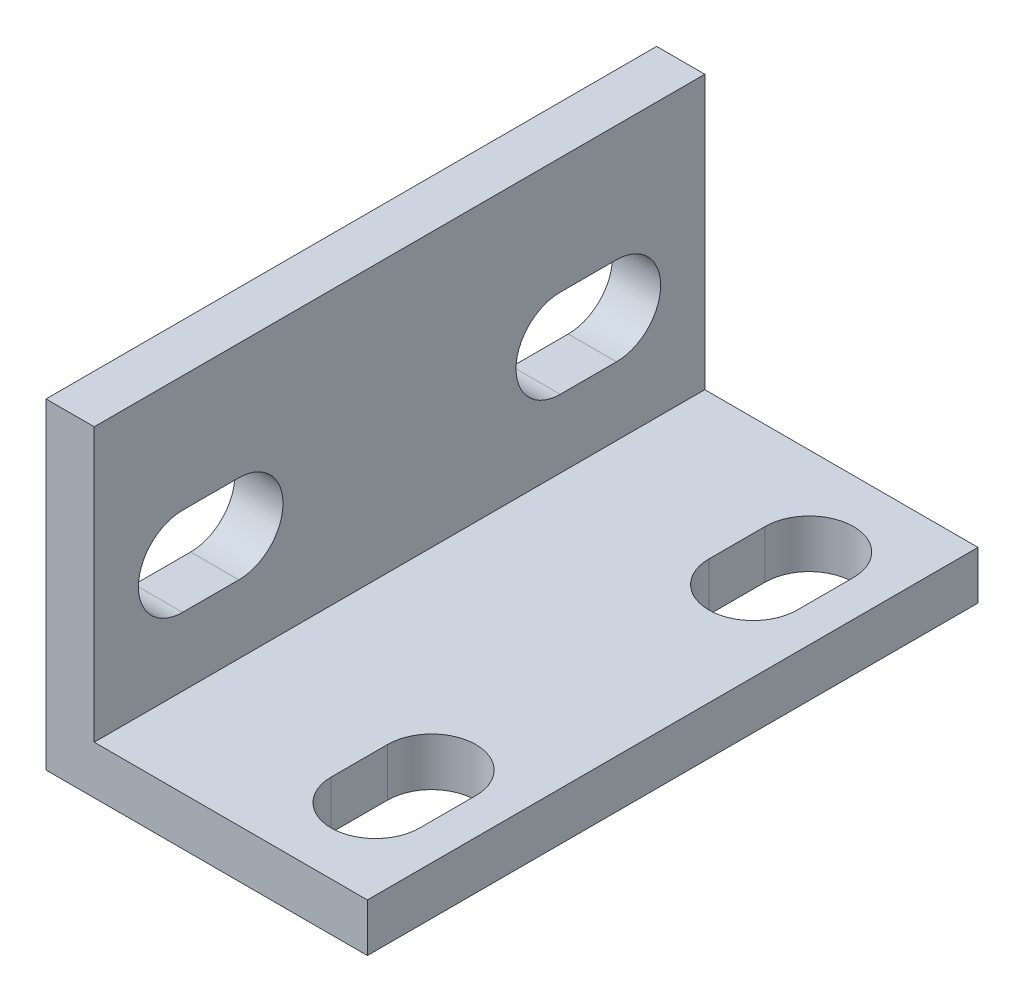
ISO-10303-21;
HEADER;
FILE_DESCRIPTION(('STEP AP214'),'2;1');
FILE_NAME('part.step','',(''),(''),'','','');
FILE_SCHEMA(('AUTOMOTIVE_DESIGN { 1 0 10303 214 1 1 1 1 }'));
ENDSEC;
DATA;
#1=APPLICATION_CONTEXT('core data for automotive mechanical design processes');
#2=APPLICATION_PROTOCOL_DEFINITION('international standard','automotive_design',2000,#1);
#3=PRODUCT_CONTEXT('',#1,'mechanical');
#4=PRODUCT('Part','Part','',(#3));
#5=PRODUCT_RELATED_PRODUCT_CATEGORY('part','',(#4));
#6=PRODUCT_DEFINITION_FORMATION('','',#4);
#7=PRODUCT_DEFINITION_CONTEXT('part definition',#1,'design');
#8=PRODUCT_DEFINITION('design','',#6,#7);
#9=PRODUCT_DEFINITION_SHAPE('','',#8);
#10=(LENGTH_UNIT() NAMED_UNIT(*) SI_UNIT(.MILLI.,.METRE.));
#11=(NAMED_UNIT(*) PLANE_ANGLE_UNIT() SI_UNIT($,.RADIAN.));
#12=(NAMED_UNIT(*) SI_UNIT($,.STERADIAN.) SOLID_ANGLE_UNIT());
#13=UNCERTAINTY_MEASURE_WITH_UNIT(LENGTH_MEASURE(1.E-05),#10,'distance_accuracy_value','');
#14=(GEOMETRIC_REPRESENTATION_CONTEXT(3) GLOBAL_UNCERTAINTY_ASSIGNED_CONTEXT((#13)) GLOBAL_UNIT_ASSIGNED_CONTEXT((#10,
#11,#12)) REPRESENTATION_CONTEXT('',''));
#15=CARTESIAN_POINT('',(0.,0.,0.));
#16=DIRECTION('',(0.,0.,1.));
#17=DIRECTION('',(1.,0.,0.));
#18=AXIS2_PLACEMENT_3D('',#15,#16,#17);
#19=CARTESIAN_POINT('',(0.,0.,38.));
#20=DIRECTION('',(0.,1.,0.));
#21=DIRECTION('',(0.,0.,1.));
#22=AXIS2_PLACEMENT_3D('',#19,#20,#21);
#23=PLANE('',#22);
#24=DIRECTION('',(0.,0.,-1.));
#25=VECTOR('',#24,1.);
#26=CARTESIAN_POINT('',(17.75,0.,5.49999999999999));
#27=LINE('',#26,#25);
#28=CARTESIAN_POINT('',(17.75,0.,9.));
#29=VERTEX_POINT('',#28);
#30=CARTESIAN_POINT('',(17.75,0.,5.49999999999999));
#31=VERTEX_POINT('',#30);
#32=EDGE_CURVE('E191',#29,#31,#27,.T.);
#33=ORIENTED_EDGE('',*,*,#32,.T.);
#34=CARTESIAN_POINT('',(15.,0.,5.49999999999999));
#35=DIRECTION('',(0.,1.,0.));
#36=DIRECTION('',(0.,0.,-1.));
#37=AXIS2_PLACEMENT_3D('',#34,#35,#36);
#38=CIRCLE('',#37,2.75000000000001);
#39=CARTESIAN_POINT('',(12.25,0.,5.49999999999999));
#40=VERTEX_POINT('',#39);
#41=EDGE_CURVE('E185',#31,#40,#38,.T.);
#42=ORIENTED_EDGE('',*,*,#41,.T.);
#43=DIRECTION('',(0.,0.,1.));
#44=VECTOR('',#43,1.);
#45=CARTESIAN_POINT('',(12.25,0.,5.49999999999999));
#46=LINE('',#45,#44);
#47=CARTESIAN_POINT('',(12.25,0.,9.));
#48=VERTEX_POINT('',#47);
#49=EDGE_CURVE('E194',#40,#48,#46,.T.);
#50=ORIENTED_EDGE('',*,*,#49,.T.);
#51=CARTESIAN_POINT('',(15.,0.,9.));
#52=DIRECTION('',(0.,1.,0.));
#53=DIRECTION('',(0.,0.,-1.));
#54=AXIS2_PLACEMENT_3D('',#51,#52,#53);
#55=CIRCLE('',#54,2.75000000000001);
#56=EDGE_CURVE('E50',#48,#29,#55,.T.);
#57=ORIENTED_EDGE('',*,*,#56,.T.);
#58=EDGE_LOOP('',(#33,#42,#50,#57));
#59=FACE_BOUND('',#58,.T.);
#60=DIRECTION('',(0.,0.,1.));
#61=VECTOR('',#60,1.);
#62=CARTESIAN_POINT('',(12.25,0.,32.5));
#63=LINE('',#62,#61);
#64=CARTESIAN_POINT('',(12.25,0.,29.));
#65=VERTEX_POINT('',#64);
#66=CARTESIAN_POINT('',(12.25,0.,32.5));
#67=VERTEX_POINT('',#66);
#68=EDGE_CURVE('E229',#65,#67,#63,.T.);
#69=ORIENTED_EDGE('',*,*,#68,.T.);
#70=CARTESIAN_POINT('',(15.,0.,32.5));
#71=DIRECTION('',(0.,1.,0.));
#72=DIRECTION('',(0.,0.,1.));
#73=AXIS2_PLACEMENT_3D('',#70,#71,#72);
#74=CIRCLE('',#73,2.75);
#75=CARTESIAN_POINT('',(17.75,0.,32.5));
#76=VERTEX_POINT('',#75);
#77=EDGE_CURVE('E219',#67,#76,#74,.T.);
#78=ORIENTED_EDGE('',*,*,#77,.T.);
#79=DIRECTION('',(0.,0.,-1.));
#80=VECTOR('',#79,1.);
#81=CARTESIAN_POINT('',(17.75,0.,32.5));
#82=LINE('',#81,#80);
#83=CARTESIAN_POINT('',(17.75,0.,29.));
#84=VERTEX_POINT('',#83);
#85=EDGE_CURVE('E222',#76,#84,#82,.T.);
#86=ORIENTED_EDGE('',*,*,#85,.T.);
#87=CARTESIAN_POINT('',(15.,0.,29.));
#88=DIRECTION('',(0.,1.,0.));
#89=DIRECTION('',(0.,0.,1.));
#90=AXIS2_PLACEMENT_3D('',#87,#88,#89);
#91=CIRCLE('',#90,2.75000000000001);
#92=EDGE_CURVE('E226',#84,#65,#91,.T.);
#93=ORIENTED_EDGE('',*,*,#92,.T.);
#94=EDGE_LOOP('',(#69,#78,#86,#93));
#95=FACE_BOUND('',#94,.T.);
#96=DIRECTION('',(1.,0.,0.));
#97=VECTOR('',#96,1.);
#98=CARTESIAN_POINT('',(0.,0.,0.));
#99=LINE('',#98,#97);
#100=CARTESIAN_POINT('',(0.,0.,0.));
#101=VERTEX_POINT('',#100);
#102=CARTESIAN_POINT('',(20.,0.,0.));
#103=VERTEX_POINT('',#102);
#104=EDGE_CURVE('E308',#101,#103,#99,.T.);
#105=ORIENTED_EDGE('',*,*,#104,.T.);
#106=DIRECTION('',(0.,0.,-1.));
#107=VECTOR('',#106,1.);
#108=CARTESIAN_POINT('',(20.,0.,38.));
#109=LINE('',#108,#107);
#110=CARTESIAN_POINT('',(20.,0.,38.));
#111=VERTEX_POINT('',#110);
#112=EDGE_CURVE('E11',#111,#103,#109,.T.);
#113=ORIENTED_EDGE('',*,*,#112,.F.);
#114=DIRECTION('',(1.,0.,0.));
#115=VECTOR('',#114,1.);
#116=CARTESIAN_POINT('',(0.,0.,38.));
#117=LINE('',#116,#115);
#118=CARTESIAN_POINT('',(0.,0.,38.));
#119=VERTEX_POINT('',#118);
#120=EDGE_CURVE('E315',#119,#111,#117,.T.);
#121=ORIENTED_EDGE('',*,*,#120,.F.);
#122=DIRECTION('',(0.,0.,-1.));
#123=VECTOR('',#122,1.);
#124=CARTESIAN_POINT('',(0.,0.,38.));
#125=LINE('',#124,#123);
#126=EDGE_CURVE('E332',#119,#101,#125,.T.);
#127=ORIENTED_EDGE('',*,*,#126,.T.);
#128=EDGE_LOOP('',(#105,#113,#121,#127));
#129=FACE_BOUND('',#128,.T.);
#130=ADVANCED_FACE('F36',(#59,#95,#129),#23,.F.);
#131=CARTESIAN_POINT('',(20.,3.,38.));
#132=DIRECTION('',(1.,0.,0.));
#133=DIRECTION('',(0.,0.,-1.));
#134=AXIS2_PLACEMENT_3D('',#131,#132,#133);
#135=PLANE('',#134);
#136=DIRECTION('',(0.,-1.,0.));
#137=VECTOR('',#136,1.);
#138=CARTESIAN_POINT('',(20.,3.,0.));
#139=LINE('',#138,#137);
#140=CARTESIAN_POINT('',(20.,3.,0.));
#141=VERTEX_POINT('',#140);
#142=EDGE_CURVE('E335',#141,#103,#139,.T.);
#143=ORIENTED_EDGE('',*,*,#142,.F.);
#144=DIRECTION('',(0.,0.,-1.));
#145=VECTOR('',#144,1.);
#146=CARTESIAN_POINT('',(20.,3.,38.));
#147=LINE('',#146,#145);
#148=CARTESIAN_POINT('',(20.,3.,38.));
#149=VERTEX_POINT('',#148);
#150=EDGE_CURVE('E43',#149,#141,#147,.T.);
#151=ORIENTED_EDGE('',*,*,#150,.F.);
#152=DIRECTION('',(0.,-1.,0.));
#153=VECTOR('',#152,1.);
#154=CARTESIAN_POINT('',(20.,3.,38.));
#155=LINE('',#154,#153);
#156=EDGE_CURVE('E317',#149,#111,#155,.T.);
#157=ORIENTED_EDGE('',*,*,#156,.T.);
#158=ORIENTED_EDGE('',*,*,#112,.T.);
#159=EDGE_LOOP('',(#143,#151,#157,#158));
#160=FACE_BOUND('',#159,.T.);
#161=ADVANCED_FACE('F362',(#160),#135,.T.);
#162=CARTESIAN_POINT('',(0.,3.,38.));
#163=DIRECTION('',(0.,1.,0.));
#164=DIRECTION('',(0.,0.,1.));
#165=AXIS2_PLACEMENT_3D('',#162,#163,#164);
#166=PLANE('',#165);
#167=CARTESIAN_POINT('',(15.,3.,5.49999999999999));
#168=DIRECTION('',(0.,1.,0.));
#169=DIRECTION('',(0.,0.,-1.));
#170=AXIS2_PLACEMENT_3D('',#167,#168,#169);
#171=CIRCLE('',#170,2.75000000000001);
#172=CARTESIAN_POINT('',(17.75,3.,5.49999999999999));
#173=VERTEX_POINT('',#172);
#174=CARTESIAN_POINT('',(12.25,3.,5.5));
#175=VERTEX_POINT('',#174);
#176=EDGE_CURVE('E58',#173,#175,#171,.T.);
#177=ORIENTED_EDGE('',*,*,#176,.F.);
#178=DIRECTION('',(0.,0.,-1.));
#179=VECTOR('',#178,1.);
#180=CARTESIAN_POINT('',(17.75,3.,5.49999999999999));
#181=LINE('',#180,#179);
#182=CARTESIAN_POINT('',(17.75,3.,9.));
#183=VERTEX_POINT('',#182);
#184=EDGE_CURVE('E200',#183,#173,#181,.T.);
#185=ORIENTED_EDGE('',*,*,#184,.F.);
#186=CARTESIAN_POINT('',(15.,3.,9.));
#187=DIRECTION('',(0.,1.,0.));
#188=DIRECTION('',(0.,0.,-1.));
#189=AXIS2_PLACEMENT_3D('',#186,#187,#188);
#190=CIRCLE('',#189,2.75000000000001);
#191=CARTESIAN_POINT('',(12.25,3.,9.));
#192=VERTEX_POINT('',#191);
#193=EDGE_CURVE('E203',#192,#183,#190,.T.);
#194=ORIENTED_EDGE('',*,*,#193,.F.);
#195=DIRECTION('',(0.,0.,1.));
#196=VECTOR('',#195,1.);
#197=CARTESIAN_POINT('',(12.25,3.,5.49999999999999));
#198=LINE('',#197,#196);
#199=EDGE_CURVE('E209',#175,#192,#198,.T.);
#200=ORIENTED_EDGE('',*,*,#199,.F.);
#201=EDGE_LOOP('',(#177,#185,#194,#200));
#202=FACE_BOUND('',#201,.T.);
#203=CARTESIAN_POINT('',(15.,3.,32.5));
#204=DIRECTION('',(0.,1.,0.));
#205=DIRECTION('',(0.,0.,1.));
#206=AXIS2_PLACEMENT_3D('',#203,#204,#205);
#207=CIRCLE('',#206,2.75);
#208=CARTESIAN_POINT('',(12.25,3.,32.5));
#209=VERTEX_POINT('',#208);
#210=CARTESIAN_POINT('',(17.75,3.,32.5));
#211=VERTEX_POINT('',#210);
#212=EDGE_CURVE('E215',#209,#211,#207,.T.);
#213=ORIENTED_EDGE('',*,*,#212,.F.);
#214=DIRECTION('',(0.,0.,1.));
#215=VECTOR('',#214,1.);
#216=CARTESIAN_POINT('',(12.25,3.,32.5));
#217=LINE('',#216,#215);
#218=CARTESIAN_POINT('',(12.25,3.,29.));
#219=VERTEX_POINT('',#218);
#220=EDGE_CURVE('E223',#219,#209,#217,.T.);
#221=ORIENTED_EDGE('',*,*,#220,.F.);
#222=CARTESIAN_POINT('',(15.,3.,29.));
#223=DIRECTION('',(0.,1.,0.));
#224=DIRECTION('',(0.,0.,1.));
#225=AXIS2_PLACEMENT_3D('',#222,#223,#224);
#226=CIRCLE('',#225,2.75000000000001);
#227=CARTESIAN_POINT('',(17.75,3.,29.));
#228=VERTEX_POINT('',#227);
#229=EDGE_CURVE('E237',#228,#219,#226,.T.);
#230=ORIENTED_EDGE('',*,*,#229,.F.);
#231=DIRECTION('',(0.,0.,-1.));
#232=VECTOR('',#231,1.);
#233=CARTESIAN_POINT('',(17.75,3.,32.5));
#234=LINE('',#233,#232);
#235=EDGE_CURVE('E234',#211,#228,#234,.T.);
#236=ORIENTED_EDGE('',*,*,#235,.F.);
#237=EDGE_LOOP('',(#213,#221,#230,#236));
#238=FACE_BOUND('',#237,.T.);
#239=DIRECTION('',(1.,0.,0.));
#240=VECTOR('',#239,1.);
#241=CARTESIAN_POINT('',(0.,3.,0.));
#242=LINE('',#241,#240);
#243=CARTESIAN_POINT('',(3.,3.,0.));
#244=VERTEX_POINT('',#243);
#245=EDGE_CURVE('E338',#244,#141,#242,.T.);
#246=ORIENTED_EDGE('',*,*,#245,.F.);
#247=DIRECTION('',(0.,0.,-1.));
#248=VECTOR('',#247,1.);
#249=CARTESIAN_POINT('',(3.,3.,38.));
#250=LINE('',#249,#248);
#251=CARTESIAN_POINT('',(3.,3.,38.));
#252=VERTEX_POINT('',#251);
#253=EDGE_CURVE('E354',#252,#244,#250,.T.);
#254=ORIENTED_EDGE('',*,*,#253,.F.);
#255=DIRECTION('',(1.,0.,0.));
#256=VECTOR('',#255,1.);
#257=CARTESIAN_POINT('',(0.,3.,38.));
#258=LINE('',#257,#256);
#259=EDGE_CURVE('E321',#252,#149,#258,.T.);
#260=ORIENTED_EDGE('',*,*,#259,.T.);
#261=ORIENTED_EDGE('',*,*,#150,.T.);
#262=EDGE_LOOP('',(#246,#254,#260,#261));
#263=FACE_BOUND('',#262,.T.);
#264=ADVANCED_FACE('F358',(#202,#238,#263),#166,.T.);
#265=CARTESIAN_POINT('',(3.,20.,38.));
#266=DIRECTION('',(1.,0.,0.));
#267=DIRECTION('',(0.,0.,-1.));
#268=AXIS2_PLACEMENT_3D('',#265,#266,#267);
#269=PLANE('',#268);
#270=CARTESIAN_POINT('',(3.,10.,9.00000000000001));
#271=DIRECTION('',(1.,0.,0.));
#272=DIRECTION('',(0.,0.,1.));
#273=AXIS2_PLACEMENT_3D('',#270,#271,#272);
#274=CIRCLE('',#273,2.75);
#275=CARTESIAN_POINT('',(3.,12.75,9.00000000000001));
#276=VERTEX_POINT('',#275);
#277=CARTESIAN_POINT('',(3.,7.25,9.));
#278=VERTEX_POINT('',#277);
#279=EDGE_CURVE('E244',#276,#278,#274,.T.);
#280=ORIENTED_EDGE('',*,*,#279,.F.);
#281=DIRECTION('',(0.,0.,1.));
#282=VECTOR('',#281,1.);
#283=CARTESIAN_POINT('',(3.,12.75,9.00000000000001));
#284=LINE('',#283,#282);
#285=CARTESIAN_POINT('',(3.,12.75,5.5));
#286=VERTEX_POINT('',#285);
#287=EDGE_CURVE('E255',#286,#276,#284,.T.);
#288=ORIENTED_EDGE('',*,*,#287,.F.);
#289=CARTESIAN_POINT('',(3.,10.,5.5));
#290=DIRECTION('',(1.,0.,0.));
#291=DIRECTION('',(0.,0.,1.));
#292=AXIS2_PLACEMENT_3D('',#289,#290,#291);
#293=CIRCLE('',#292,2.75);
#294=CARTESIAN_POINT('',(3.,7.25,5.5));
#295=VERTEX_POINT('',#294);
#296=EDGE_CURVE('E269',#295,#286,#293,.T.);
#297=ORIENTED_EDGE('',*,*,#296,.F.);
#298=DIRECTION('',(0.,0.,-1.));
#299=VECTOR('',#298,1.);
#300=CARTESIAN_POINT('',(3.,7.25,9.00000000000001));
#301=LINE('',#300,#299);
#302=EDGE_CURVE('E266',#278,#295,#301,.T.);
#303=ORIENTED_EDGE('',*,*,#302,.F.);
#304=EDGE_LOOP('',(#280,#288,#297,#303));
#305=FACE_BOUND('',#304,.T.);
#306=CARTESIAN_POINT('',(3.,10.,29.));
#307=DIRECTION('',(1.,0.,0.));
#308=DIRECTION('',(0.,0.,-1.));
#309=AXIS2_PLACEMENT_3D('',#306,#307,#308);
#310=CIRCLE('',#309,2.75);
#311=CARTESIAN_POINT('',(3.,7.25,29.));
#312=VERTEX_POINT('',#311);
#313=CARTESIAN_POINT('',(3.,12.75,29.));
#314=VERTEX_POINT('',#313);
#315=EDGE_CURVE('E276',#312,#314,#310,.T.);
#316=ORIENTED_EDGE('',*,*,#315,.F.);
#317=DIRECTION('',(0.,0.,-1.));
#318=VECTOR('',#317,1.);
#319=CARTESIAN_POINT('',(3.,7.25,29.));
#320=LINE('',#319,#318);
#321=CARTESIAN_POINT('',(3.,7.25,32.5));
#322=VERTEX_POINT('',#321);
#323=EDGE_CURVE('E287',#322,#312,#320,.T.);
#324=ORIENTED_EDGE('',*,*,#323,.F.);
#325=CARTESIAN_POINT('',(3.,10.,32.5));
#326=DIRECTION('',(1.,0.,0.));
#327=DIRECTION('',(0.,0.,-1.));
#328=AXIS2_PLACEMENT_3D('',#325,#326,#327);
#329=CIRCLE('',#328,2.75);
#330=CARTESIAN_POINT('',(3.,12.75,32.5));
#331=VERTEX_POINT('',#330);
#332=EDGE_CURVE('E301',#331,#322,#329,.T.);
#333=ORIENTED_EDGE('',*,*,#332,.F.);
#334=DIRECTION('',(0.,0.,1.));
#335=VECTOR('',#334,1.);
#336=CARTESIAN_POINT('',(3.,12.75,29.));
#337=LINE('',#336,#335);
#338=EDGE_CURVE('E298',#314,#331,#337,.T.);
#339=ORIENTED_EDGE('',*,*,#338,.F.);
#340=EDGE_LOOP('',(#316,#324,#333,#339));
#341=FACE_BOUND('',#340,.T.);
#342=DIRECTION('',(0.,1.,0.));
#343=VECTOR('',#342,1.);
#344=CARTESIAN_POINT('',(3.,20.,0.));
#345=LINE('',#344,#343);
#346=CARTESIAN_POINT('',(3.,20.,0.));
#347=VERTEX_POINT('',#346);
#348=EDGE_CURVE('E341',#347,#244,#345,.F.);
#349=ORIENTED_EDGE('',*,*,#348,.F.);
#350=DIRECTION('',(0.,0.,-1.));
#351=VECTOR('',#350,1.);
#352=CARTESIAN_POINT('',(3.,20.,38.));
#353=LINE('',#352,#351);
#354=CARTESIAN_POINT('',(3.,20.,38.));
#355=VERTEX_POINT('',#354);
#356=EDGE_CURVE('E352',#355,#347,#353,.T.);
#357=ORIENTED_EDGE('',*,*,#356,.F.);
#358=DIRECTION('',(0.,1.,0.));
#359=VECTOR('',#358,1.);
#360=CARTESIAN_POINT('',(3.,20.,38.));
#361=LINE('',#360,#359);
#362=EDGE_CURVE('E324',#355,#252,#361,.F.);
#363=ORIENTED_EDGE('',*,*,#362,.T.);
#364=ORIENTED_EDGE('',*,*,#253,.T.);
#365=EDGE_LOOP('',(#349,#357,#363,#364));
#366=FACE_BOUND('',#365,.T.);
#367=ADVANCED_FACE('F371',(#305,#341,#366),#269,.T.);
#368=CARTESIAN_POINT('',(0.,20.,38.));
#369=DIRECTION('',(0.,1.,0.));
#370=DIRECTION('',(0.,0.,1.));
#371=AXIS2_PLACEMENT_3D('',#368,#369,#370);
#372=PLANE('',#371);
#373=DIRECTION('',(1.,0.,0.));
#374=VECTOR('',#373,1.);
#375=CARTESIAN_POINT('',(0.,20.,0.));
#376=LINE('',#375,#374);
#377=CARTESIAN_POINT('',(0.,20.,0.));
#378=VERTEX_POINT('',#377);
#379=EDGE_CURVE('E344',#378,#347,#376,.T.);
#380=ORIENTED_EDGE('',*,*,#379,.F.);
#381=DIRECTION('',(0.,0.,-1.));
#382=VECTOR('',#381,1.);
#383=CARTESIAN_POINT('',(0.,20.,38.));
#384=LINE('',#383,#382);
#385=CARTESIAN_POINT('',(0.,20.,38.));
#386=VERTEX_POINT('',#385);
#387=EDGE_CURVE('E350',#386,#378,#384,.T.);
#388=ORIENTED_EDGE('',*,*,#387,.F.);
#389=DIRECTION('',(1.,0.,0.));
#390=VECTOR('',#389,1.);
#391=CARTESIAN_POINT('',(0.,20.,38.));
#392=LINE('',#391,#390);
#393=EDGE_CURVE('E327',#386,#355,#392,.T.);
#394=ORIENTED_EDGE('',*,*,#393,.T.);
#395=ORIENTED_EDGE('',*,*,#356,.T.);
#396=EDGE_LOOP('',(#380,#388,#394,#395));
#397=FACE_BOUND('',#396,.T.);
#398=ADVANCED_FACE('F382',(#397),#372,.T.);
#399=CARTESIAN_POINT('',(0.,20.,38.));
#400=DIRECTION('',(1.,0.,0.));
#401=DIRECTION('',(0.,0.,-1.));
#402=AXIS2_PLACEMENT_3D('',#399,#400,#401);
#403=PLANE('',#402);
#404=DIRECTION('',(0.,0.,1.));
#405=VECTOR('',#404,1.);
#406=CARTESIAN_POINT('',(0.,12.75,9.00000000000001));
#407=LINE('',#406,#405);
#408=CARTESIAN_POINT('',(0.,12.75,5.5));
#409=VERTEX_POINT('',#408);
#410=CARTESIAN_POINT('',(0.,12.75,9.00000000000001));
#411=VERTEX_POINT('',#410);
#412=EDGE_CURVE('E261',#409,#411,#407,.T.);
#413=ORIENTED_EDGE('',*,*,#412,.T.);
#414=CARTESIAN_POINT('',(0.,10.,9.00000000000001));
#415=DIRECTION('',(1.,0.,0.));
#416=DIRECTION('',(0.,0.,1.));
#417=AXIS2_PLACEMENT_3D('',#414,#415,#416);
#418=CIRCLE('',#417,2.75);
#419=CARTESIAN_POINT('',(0.,7.25,9.00000000000001));
#420=VERTEX_POINT('',#419);
#421=EDGE_CURVE('E251',#411,#420,#418,.T.);
#422=ORIENTED_EDGE('',*,*,#421,.T.);
#423=DIRECTION('',(0.,0.,-1.));
#424=VECTOR('',#423,1.);
#425=CARTESIAN_POINT('',(0.,7.25,9.00000000000001));
#426=LINE('',#425,#424);
#427=CARTESIAN_POINT('',(0.,7.25,5.50000000000001));
#428=VERTEX_POINT('',#427);
#429=EDGE_CURVE('E254',#420,#428,#426,.T.);
#430=ORIENTED_EDGE('',*,*,#429,.T.);
#431=CARTESIAN_POINT('',(0.,10.,5.5));
#432=DIRECTION('',(1.,0.,0.));
#433=DIRECTION('',(0.,0.,1.));
#434=AXIS2_PLACEMENT_3D('',#431,#432,#433);
#435=CIRCLE('',#434,2.75);
#436=EDGE_CURVE('E258',#428,#409,#435,.T.);
#437=ORIENTED_EDGE('',*,*,#436,.T.);
#438=EDGE_LOOP('',(#413,#422,#430,#437));
#439=FACE_BOUND('',#438,.T.);
#440=DIRECTION('',(0.,0.,-1.));
#441=VECTOR('',#440,1.);
#442=CARTESIAN_POINT('',(0.,7.25,29.));
#443=LINE('',#442,#441);
#444=CARTESIAN_POINT('',(0.,7.25,32.5));
#445=VERTEX_POINT('',#444);
#446=CARTESIAN_POINT('',(0.,7.25,29.));
#447=VERTEX_POINT('',#446);
#448=EDGE_CURVE('E293',#445,#447,#443,.T.);
#449=ORIENTED_EDGE('',*,*,#448,.T.);
#450=CARTESIAN_POINT('',(0.,10.,29.));
#451=DIRECTION('',(1.,0.,0.));
#452=DIRECTION('',(0.,0.,-1.));
#453=AXIS2_PLACEMENT_3D('',#450,#451,#452);
#454=CIRCLE('',#453,2.75);
#455=CARTESIAN_POINT('',(0.,12.75,29.));
#456=VERTEX_POINT('',#455);
#457=EDGE_CURVE('E283',#447,#456,#454,.T.);
#458=ORIENTED_EDGE('',*,*,#457,.T.);
#459=DIRECTION('',(0.,0.,1.));
#460=VECTOR('',#459,1.);
#461=CARTESIAN_POINT('',(0.,12.75,29.));
#462=LINE('',#461,#460);
#463=CARTESIAN_POINT('',(0.,12.75,32.5));
#464=VERTEX_POINT('',#463);
#465=EDGE_CURVE('E286',#456,#464,#462,.T.);
#466=ORIENTED_EDGE('',*,*,#465,.T.);
#467=CARTESIAN_POINT('',(0.,10.,32.5));
#468=DIRECTION('',(1.,0.,0.));
#469=DIRECTION('',(0.,0.,-1.));
#470=AXIS2_PLACEMENT_3D('',#467,#468,#469);
#471=CIRCLE('',#470,2.75);
#472=EDGE_CURVE('E290',#464,#445,#471,.T.);
#473=ORIENTED_EDGE('',*,*,#472,.T.);
#474=EDGE_LOOP('',(#449,#458,#466,#473));
#475=FACE_BOUND('',#474,.T.);
#476=DIRECTION('',(0.,-1.,0.));
#477=VECTOR('',#476,1.);
#478=CARTESIAN_POINT('',(0.,20.,0.));
#479=LINE('',#478,#477);
#480=EDGE_CURVE('E318',#378,#101,#479,.T.);
#481=ORIENTED_EDGE('',*,*,#480,.T.);
#482=ORIENTED_EDGE('',*,*,#126,.F.);
#483=DIRECTION('',(0.,-1.,0.));
#484=VECTOR('',#483,1.);
#485=CARTESIAN_POINT('',(0.,20.,38.));
#486=LINE('',#485,#484);
#487=EDGE_CURVE('E330',#386,#119,#486,.T.);
#488=ORIENTED_EDGE('',*,*,#487,.F.);
#489=ORIENTED_EDGE('',*,*,#387,.T.);
#490=EDGE_LOOP('',(#481,#482,#488,#489));
#491=FACE_BOUND('',#490,.T.);
#492=ADVANCED_FACE('F383',(#439,#475,#491),#403,.F.);
#493=CARTESIAN_POINT('',(0.,0.,38.));
#494=DIRECTION('',(0.,0.,-1.));
#495=DIRECTION('',(-1.,0.,0.));
#496=AXIS2_PLACEMENT_3D('',#493,#494,#495);
#497=PLANE('',#496);
#498=ORIENTED_EDGE('',*,*,#120,.T.);
#499=ORIENTED_EDGE('',*,*,#156,.F.);
#500=ORIENTED_EDGE('',*,*,#259,.F.);
#501=ORIENTED_EDGE('',*,*,#362,.F.);
#502=ORIENTED_EDGE('',*,*,#393,.F.);
#503=ORIENTED_EDGE('',*,*,#487,.T.);
#504=EDGE_LOOP('',(#498,#499,#500,#501,#502,#503));
#505=FACE_BOUND('',#504,.T.);
#506=ADVANCED_FACE('F374',(#505),#497,.F.);
#507=CARTESIAN_POINT('',(0.,0.,0.));
#508=DIRECTION('',(0.,0.,-1.));
#509=DIRECTION('',(-1.,0.,0.));
#510=AXIS2_PLACEMENT_3D('',#507,#508,#509);
#511=PLANE('',#510);
#512=ORIENTED_EDGE('',*,*,#104,.F.);
#513=ORIENTED_EDGE('',*,*,#480,.F.);
#514=ORIENTED_EDGE('',*,*,#379,.T.);
#515=ORIENTED_EDGE('',*,*,#348,.T.);
#516=ORIENTED_EDGE('',*,*,#245,.T.);
#517=ORIENTED_EDGE('',*,*,#142,.T.);
#518=EDGE_LOOP('',(#512,#513,#514,#515,#516,#517));
#519=FACE_BOUND('',#518,.T.);
#520=ADVANCED_FACE('F366',(#519),#511,.T.);
#521=CARTESIAN_POINT('',(0.,10.,29.));
#522=DIRECTION('',(1.,0.,0.));
#523=DIRECTION('',(0.,0.,-1.));
#524=AXIS2_PLACEMENT_3D('',#521,#522,#523);
#525=CYLINDRICAL_SURFACE('',#524,2.75);
#526=ORIENTED_EDGE('',*,*,#315,.T.);
#527=DIRECTION('',(1.,0.,0.));
#528=VECTOR('',#527,1.);
#529=CARTESIAN_POINT('',(0.,12.75,29.));
#530=LINE('',#529,#528);
#531=EDGE_CURVE('E296',#456,#314,#530,.T.);
#532=ORIENTED_EDGE('',*,*,#531,.F.);
#533=ORIENTED_EDGE('',*,*,#457,.F.);
#534=DIRECTION('',(1.,0.,0.));
#535=VECTOR('',#534,1.);
#536=CARTESIAN_POINT('',(0.,7.25,29.));
#537=LINE('',#536,#535);
#538=EDGE_CURVE('E306',#447,#312,#537,.T.);
#539=ORIENTED_EDGE('',*,*,#538,.T.);
#540=EDGE_LOOP('',(#526,#532,#533,#539));
#541=FACE_BOUND('',#540,.T.);
#542=ADVANCED_FACE('F418',(#541),#525,.F.);
#543=CARTESIAN_POINT('',(0.,7.25,29.));
#544=DIRECTION('',(0.,-1.,0.));
#545=DIRECTION('',(0.,0.,-1.));
#546=AXIS2_PLACEMENT_3D('',#543,#544,#545);
#547=PLANE('',#546);
#548=ORIENTED_EDGE('',*,*,#323,.T.);
#549=ORIENTED_EDGE('',*,*,#538,.F.);
#550=ORIENTED_EDGE('',*,*,#448,.F.);
#551=DIRECTION('',(1.,0.,0.));
#552=VECTOR('',#551,1.);
#553=CARTESIAN_POINT('',(0.,7.25,32.5));
#554=LINE('',#553,#552);
#555=EDGE_CURVE('E309',#445,#322,#554,.T.);
#556=ORIENTED_EDGE('',*,*,#555,.T.);
#557=EDGE_LOOP('',(#548,#549,#550,#556));
#558=FACE_BOUND('',#557,.T.);
#559=ADVANCED_FACE('F426',(#558),#547,.F.);
#560=CARTESIAN_POINT('',(0.,10.,32.5));
#561=DIRECTION('',(1.,0.,0.));
#562=DIRECTION('',(0.,0.,-1.));
#563=AXIS2_PLACEMENT_3D('',#560,#561,#562);
#564=CYLINDRICAL_SURFACE('',#563,2.75);
#565=ORIENTED_EDGE('',*,*,#332,.T.);
#566=ORIENTED_EDGE('',*,*,#555,.F.);
#567=ORIENTED_EDGE('',*,*,#472,.F.);
#568=DIRECTION('',(1.,0.,0.));
#569=VECTOR('',#568,1.);
#570=CARTESIAN_POINT('',(0.,12.75,32.5));
#571=LINE('',#570,#569);
#572=EDGE_CURVE('E311',#464,#331,#571,.T.);
#573=ORIENTED_EDGE('',*,*,#572,.T.);
#574=EDGE_LOOP('',(#565,#566,#567,#573));
#575=FACE_BOUND('',#574,.T.);
#576=ADVANCED_FACE('F428',(#575),#564,.F.);
#577=CARTESIAN_POINT('',(0.,12.75,29.));
#578=DIRECTION('',(0.,1.,0.));
#579=DIRECTION('',(0.,0.,1.));
#580=AXIS2_PLACEMENT_3D('',#577,#578,#579);
#581=PLANE('',#580);
#582=ORIENTED_EDGE('',*,*,#338,.T.);
#583=ORIENTED_EDGE('',*,*,#572,.F.);
#584=ORIENTED_EDGE('',*,*,#465,.F.);
#585=ORIENTED_EDGE('',*,*,#531,.T.);
#586=EDGE_LOOP('',(#582,#583,#584,#585));
#587=FACE_BOUND('',#586,.T.);
#588=ADVANCED_FACE('F422',(#587),#581,.F.);
#589=CARTESIAN_POINT('',(0.,10.,9.00000000000001));
#590=DIRECTION('',(1.,0.,0.));
#591=DIRECTION('',(0.,0.,-1.));
#592=AXIS2_PLACEMENT_3D('',#589,#590,#591);
#593=CYLINDRICAL_SURFACE('',#592,2.75);
#594=ORIENTED_EDGE('',*,*,#279,.T.);
#595=DIRECTION('',(1.,0.,0.));
#596=VECTOR('',#595,1.);
#597=CARTESIAN_POINT('',(0.,7.25,9.00000000000001));
#598=LINE('',#597,#596);
#599=EDGE_CURVE('E264',#420,#278,#598,.T.);
#600=ORIENTED_EDGE('',*,*,#599,.F.);
#601=ORIENTED_EDGE('',*,*,#421,.F.);
#602=DIRECTION('',(1.,0.,0.));
#603=VECTOR('',#602,1.);
#604=CARTESIAN_POINT('',(0.,12.75,9.00000000000001));
#605=LINE('',#604,#603);
#606=EDGE_CURVE('E274',#411,#276,#605,.T.);
#607=ORIENTED_EDGE('',*,*,#606,.T.);
#608=EDGE_LOOP('',(#594,#600,#601,#607));
#609=FACE_BOUND('',#608,.T.);
#610=ADVANCED_FACE('F435',(#609),#593,.F.);
#611=CARTESIAN_POINT('',(0.,12.75,9.00000000000001));
#612=DIRECTION('',(0.,1.,0.));
#613=DIRECTION('',(0.,0.,1.));
#614=AXIS2_PLACEMENT_3D('',#611,#612,#613);
#615=PLANE('',#614);
#616=ORIENTED_EDGE('',*,*,#287,.T.);
#617=ORIENTED_EDGE('',*,*,#606,.F.);
#618=ORIENTED_EDGE('',*,*,#412,.F.);
#619=DIRECTION('',(1.,0.,0.));
#620=VECTOR('',#619,1.);
#621=CARTESIAN_POINT('',(0.,12.75,5.5));
#622=LINE('',#621,#620);
#623=EDGE_CURVE('E277',#409,#286,#622,.T.);
#624=ORIENTED_EDGE('',*,*,#623,.T.);
#625=EDGE_LOOP('',(#616,#617,#618,#624));
#626=FACE_BOUND('',#625,.T.);
#627=ADVANCED_FACE('F473',(#626),#615,.F.);
#628=CARTESIAN_POINT('',(0.,10.,5.5));
#629=DIRECTION('',(1.,0.,0.));
#630=DIRECTION('',(0.,0.,-1.));
#631=AXIS2_PLACEMENT_3D('',#628,#629,#630);
#632=CYLINDRICAL_SURFACE('',#631,2.75);
#633=ORIENTED_EDGE('',*,*,#296,.T.);
#634=ORIENTED_EDGE('',*,*,#623,.F.);
#635=ORIENTED_EDGE('',*,*,#436,.F.);
#636=DIRECTION('',(1.,0.,0.));
#637=VECTOR('',#636,1.);
#638=CARTESIAN_POINT('',(0.,7.25,5.5));
#639=LINE('',#638,#637);
#640=EDGE_CURVE('E279',#428,#295,#639,.T.);
#641=ORIENTED_EDGE('',*,*,#640,.T.);
#642=EDGE_LOOP('',(#633,#634,#635,#641));
#643=FACE_BOUND('',#642,.T.);
#644=ADVANCED_FACE('F482',(#643),#632,.F.);
#645=CARTESIAN_POINT('',(0.,7.25,9.00000000000001));
#646=DIRECTION('',(0.,-1.,0.));
#647=DIRECTION('',(0.,0.,-1.));
#648=AXIS2_PLACEMENT_3D('',#645,#646,#647);
#649=PLANE('',#648);
#650=ORIENTED_EDGE('',*,*,#302,.T.);
#651=ORIENTED_EDGE('',*,*,#640,.F.);
#652=ORIENTED_EDGE('',*,*,#429,.F.);
#653=ORIENTED_EDGE('',*,*,#599,.T.);
#654=EDGE_LOOP('',(#650,#651,#652,#653));
#655=FACE_BOUND('',#654,.T.);
#656=ADVANCED_FACE('F492',(#655),#649,.F.);
#657=CARTESIAN_POINT('',(15.,0.,32.5));
#658=DIRECTION('',(0.,1.,0.));
#659=DIRECTION('',(0.,0.,1.));
#660=AXIS2_PLACEMENT_3D('',#657,#658,#659);
#661=CYLINDRICAL_SURFACE('',#660,2.75);
#662=ORIENTED_EDGE('',*,*,#212,.T.);
#663=DIRECTION('',(0.,1.,0.));
#664=VECTOR('',#663,1.);
#665=CARTESIAN_POINT('',(17.75,0.,32.5));
#666=LINE('',#665,#664);
#667=EDGE_CURVE('E232',#76,#211,#666,.T.);
#668=ORIENTED_EDGE('',*,*,#667,.F.);
#669=ORIENTED_EDGE('',*,*,#77,.F.);
#670=DIRECTION('',(0.,1.,0.));
#671=VECTOR('',#670,1.);
#672=CARTESIAN_POINT('',(12.25,0.,32.5));
#673=LINE('',#672,#671);
#674=EDGE_CURVE('E242',#67,#209,#673,.T.);
#675=ORIENTED_EDGE('',*,*,#674,.T.);
#676=EDGE_LOOP('',(#662,#668,#669,#675));
#677=FACE_BOUND('',#676,.T.);
#678=ADVANCED_FACE('F501',(#677),#661,.F.);
#679=CARTESIAN_POINT('',(12.25,0.,32.5));
#680=DIRECTION('',(-1.,0.,0.));
#681=DIRECTION('',(0.,0.,1.));
#682=AXIS2_PLACEMENT_3D('',#679,#680,#681);
#683=PLANE('',#682);
#684=ORIENTED_EDGE('',*,*,#220,.T.);
#685=ORIENTED_EDGE('',*,*,#674,.F.);
#686=ORIENTED_EDGE('',*,*,#68,.F.);
#687=DIRECTION('',(0.,1.,0.));
#688=VECTOR('',#687,1.);
#689=CARTESIAN_POINT('',(12.25,0.,29.));
#690=LINE('',#689,#688);
#691=EDGE_CURVE('E245',#65,#219,#690,.T.);
#692=ORIENTED_EDGE('',*,*,#691,.T.);
#693=EDGE_LOOP('',(#684,#685,#686,#692));
#694=FACE_BOUND('',#693,.T.);
#695=ADVANCED_FACE('F524',(#694),#683,.F.);
#696=CARTESIAN_POINT('',(15.,0.,29.));
#697=DIRECTION('',(0.,1.,0.));
#698=DIRECTION('',(0.,0.,1.));
#699=AXIS2_PLACEMENT_3D('',#696,#697,#698);
#700=CYLINDRICAL_SURFACE('',#699,2.75000000000001);
#701=ORIENTED_EDGE('',*,*,#229,.T.);
#702=ORIENTED_EDGE('',*,*,#691,.F.);
#703=ORIENTED_EDGE('',*,*,#92,.F.);
#704=DIRECTION('',(0.,1.,0.));
#705=VECTOR('',#704,1.);
#706=CARTESIAN_POINT('',(17.75,0.,29.));
#707=LINE('',#706,#705);
#708=EDGE_CURVE('E247',#84,#228,#707,.T.);
#709=ORIENTED_EDGE('',*,*,#708,.T.);
#710=EDGE_LOOP('',(#701,#702,#703,#709));
#711=FACE_BOUND('',#710,.T.);
#712=ADVANCED_FACE('F534',(#711),#700,.F.);
#713=CARTESIAN_POINT('',(17.75,0.,32.5));
#714=DIRECTION('',(1.,0.,0.));
#715=DIRECTION('',(0.,0.,-1.));
#716=AXIS2_PLACEMENT_3D('',#713,#714,#715);
#717=PLANE('',#716);
#718=ORIENTED_EDGE('',*,*,#235,.T.);
#719=ORIENTED_EDGE('',*,*,#708,.F.);
#720=ORIENTED_EDGE('',*,*,#85,.F.);
#721=ORIENTED_EDGE('',*,*,#667,.T.);
#722=EDGE_LOOP('',(#718,#719,#720,#721));
#723=FACE_BOUND('',#722,.T.);
#724=ADVANCED_FACE('F544',(#723),#717,.F.);
#725=CARTESIAN_POINT('',(15.,0.,5.49999999999999));
#726=DIRECTION('',(0.,1.,0.));
#727=DIRECTION('',(0.,0.,1.));
#728=AXIS2_PLACEMENT_3D('',#725,#726,#727);
#729=CYLINDRICAL_SURFACE('',#728,2.75000000000001);
#730=ORIENTED_EDGE('',*,*,#176,.T.);
#731=DIRECTION('',(0.,1.,0.));
#732=VECTOR('',#731,1.);
#733=CARTESIAN_POINT('',(12.25,0.,5.49999999999999));
#734=LINE('',#733,#732);
#735=EDGE_CURVE('E181',#40,#175,#734,.T.);
#736=ORIENTED_EDGE('',*,*,#735,.F.);
#737=ORIENTED_EDGE('',*,*,#41,.F.);
#738=DIRECTION('',(0.,1.,0.));
#739=VECTOR('',#738,1.);
#740=CARTESIAN_POINT('',(17.75,0.,5.49999999999999));
#741=LINE('',#740,#739);
#742=EDGE_CURVE('E213',#31,#173,#741,.T.);
#743=ORIENTED_EDGE('',*,*,#742,.T.);
#744=EDGE_LOOP('',(#730,#736,#737,#743));
#745=FACE_BOUND('',#744,.T.);
#746=ADVANCED_FACE('F183',(#745),#729,.F.);
#747=CARTESIAN_POINT('',(17.75,0.,5.49999999999999));
#748=DIRECTION('',(1.,0.,0.));
#749=DIRECTION('',(0.,0.,-1.));
#750=AXIS2_PLACEMENT_3D('',#747,#748,#749);
#751=PLANE('',#750);
#752=ORIENTED_EDGE('',*,*,#184,.T.);
#753=ORIENTED_EDGE('',*,*,#742,.F.);
#754=ORIENTED_EDGE('',*,*,#32,.F.);
#755=DIRECTION('',(0.,1.,0.));
#756=VECTOR('',#755,1.);
#757=CARTESIAN_POINT('',(17.75,0.,9.));
#758=LINE('',#757,#756);
#759=EDGE_CURVE('E216',#29,#183,#758,.T.);
#760=ORIENTED_EDGE('',*,*,#759,.T.);
#761=EDGE_LOOP('',(#752,#753,#754,#760));
#762=FACE_BOUND('',#761,.T.);
#763=ADVANCED_FACE('F563',(#762),#751,.F.);
#764=CARTESIAN_POINT('',(15.,0.,9.));
#765=DIRECTION('',(0.,1.,0.));
#766=DIRECTION('',(0.,0.,1.));
#767=AXIS2_PLACEMENT_3D('',#764,#765,#766);
#768=CYLINDRICAL_SURFACE('',#767,2.75000000000001);
#769=ORIENTED_EDGE('',*,*,#193,.T.);
#770=ORIENTED_EDGE('',*,*,#759,.F.);
#771=ORIENTED_EDGE('',*,*,#56,.F.);
#772=DIRECTION('',(0.,1.,0.));
#773=VECTOR('',#772,1.);
#774=CARTESIAN_POINT('',(12.25,0.,9.));
#775=LINE('',#774,#773);
#776=EDGE_CURVE('E190',#48,#192,#775,.T.);
#777=ORIENTED_EDGE('',*,*,#776,.T.);
#778=EDGE_LOOP('',(#769,#770,#771,#777));
#779=FACE_BOUND('',#778,.T.);
#780=ADVANCED_FACE('F572',(#779),#768,.F.);
#781=CARTESIAN_POINT('',(12.25,0.,5.49999999999999));
#782=DIRECTION('',(-1.,0.,0.));
#783=DIRECTION('',(0.,0.,1.));
#784=AXIS2_PLACEMENT_3D('',#781,#782,#783);
#785=PLANE('',#784);
#786=ORIENTED_EDGE('',*,*,#199,.T.);
#787=ORIENTED_EDGE('',*,*,#776,.F.);
#788=ORIENTED_EDGE('',*,*,#49,.F.);
#789=ORIENTED_EDGE('',*,*,#735,.T.);
#790=EDGE_LOOP('',(#786,#787,#788,#789));
#791=FACE_BOUND('',#790,.T.);
#792=ADVANCED_FACE('F195',(#791),#785,.F.);
#793=CLOSED_SHELL('',(#130,#161,#264,#367,#398,#492,#506,#520,#542,#559,#576,#588,#610,#627,
#644,#656,#678,#695,#712,#724,#746,#763,#780,#792));
#794=MANIFOLD_SOLID_BREP('B2',#793);
#795=ADVANCED_BREP_SHAPE_REPRESENTATION('',(#18,#794),#14);
#796=SHAPE_DEFINITION_REPRESENTATION(#9,#795);
ENDSEC;
END-ISO-10303-21;
